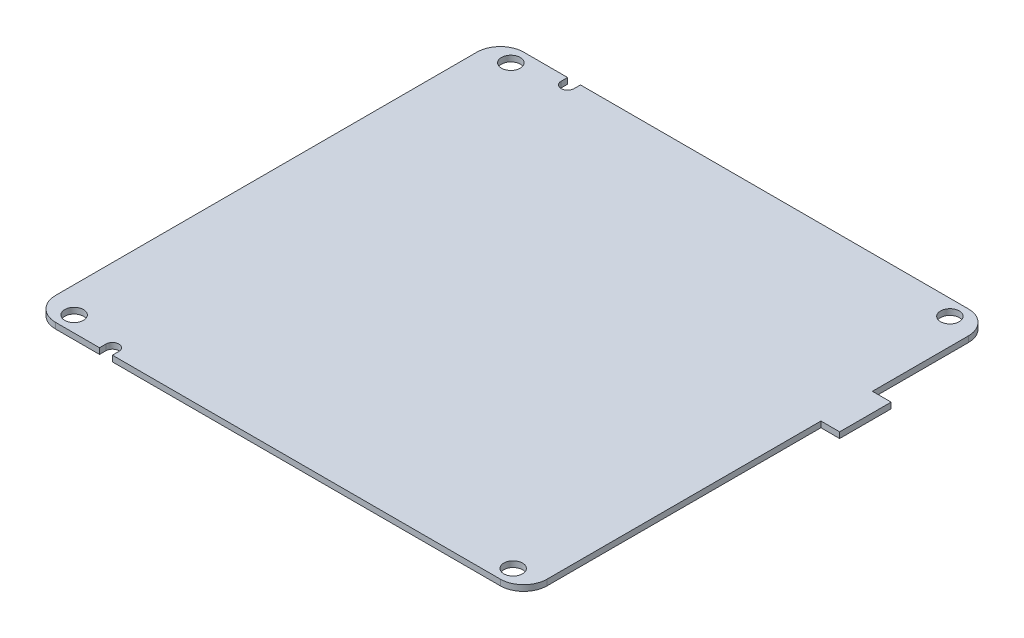
ISO-10303-21;
HEADER;
FILE_DESCRIPTION(('STEP AP214'),'2;1');
FILE_NAME('part.step','',(''),(''),'','','');
FILE_SCHEMA(('AUTOMOTIVE_DESIGN { 1 0 10303 214 1 1 1 1 }'));
ENDSEC;
DATA;
#1=APPLICATION_CONTEXT('core data for automotive mechanical design processes');
#2=APPLICATION_PROTOCOL_DEFINITION('international standard','automotive_design',2000,#1);
#3=PRODUCT_CONTEXT('',#1,'mechanical');
#4=PRODUCT('Part','Part','',(#3));
#5=PRODUCT_RELATED_PRODUCT_CATEGORY('part','',(#4));
#6=PRODUCT_DEFINITION_FORMATION('','',#4);
#7=PRODUCT_DEFINITION_CONTEXT('part definition',#1,'design');
#8=PRODUCT_DEFINITION('design','',#6,#7);
#9=PRODUCT_DEFINITION_SHAPE('','',#8);
#10=(LENGTH_UNIT() NAMED_UNIT(*) SI_UNIT(.MILLI.,.METRE.));
#11=(NAMED_UNIT(*) PLANE_ANGLE_UNIT() SI_UNIT($,.RADIAN.));
#12=(NAMED_UNIT(*) SI_UNIT($,.STERADIAN.) SOLID_ANGLE_UNIT());
#13=UNCERTAINTY_MEASURE_WITH_UNIT(LENGTH_MEASURE(1.E-05),#10,'distance_accuracy_value','');
#14=(GEOMETRIC_REPRESENTATION_CONTEXT(3) GLOBAL_UNCERTAINTY_ASSIGNED_CONTEXT((#13)) GLOBAL_UNIT_ASSIGNED_CONTEXT((#10,
#11,#12)) REPRESENTATION_CONTEXT('',''));
#15=CARTESIAN_POINT('',(0.,0.,0.));
#16=DIRECTION('',(0.,0.,1.));
#17=DIRECTION('',(1.,0.,0.));
#18=AXIS2_PLACEMENT_3D('',#15,#16,#17);
#19=CARTESIAN_POINT('',(0.,1.25,-50.));
#20=DIRECTION('',(0.,0.,-1.));
#21=DIRECTION('',(-1.,0.,0.));
#22=AXIS2_PLACEMENT_3D('',#19,#20,#21);
#23=PLANE('',#22);
#24=DIRECTION('',(1.,0.,0.));
#25=VECTOR('',#24,1.);
#26=CARTESIAN_POINT('',(0.,1.25,-50.));
#27=LINE('',#26,#25);
#28=CARTESIAN_POINT('',(-47.5,1.25,-50.));
#29=VERTEX_POINT('',#28);
#30=CARTESIAN_POINT('',(-38.125,1.25,-50.));
#31=VERTEX_POINT('',#30);
#32=EDGE_CURVE('E245',#29,#31,#27,.T.);
#33=ORIENTED_EDGE('',*,*,#32,.T.);
#34=DIRECTION('',(0.,1.,0.));
#35=VECTOR('',#34,1.);
#36=CARTESIAN_POINT('',(-38.125,-0.000999999999999916,-50.));
#37=LINE('',#36,#35);
#38=CARTESIAN_POINT('',(-38.125,0.,-50.));
#39=VERTEX_POINT('',#38);
#40=EDGE_CURVE('E197',#39,#31,#37,.T.);
#41=ORIENTED_EDGE('',*,*,#40,.F.);
#42=DIRECTION('',(1.,0.,0.));
#43=VECTOR('',#42,1.);
#44=CARTESIAN_POINT('',(0.,0.,-50.));
#45=LINE('',#44,#43);
#46=CARTESIAN_POINT('',(-47.5,0.,-50.));
#47=VERTEX_POINT('',#46);
#48=EDGE_CURVE('E267',#47,#39,#45,.T.);
#49=ORIENTED_EDGE('',*,*,#48,.F.);
#50=DIRECTION('',(0.,-1.,0.));
#51=VECTOR('',#50,1.);
#52=CARTESIAN_POINT('',(-47.5,1.25,-50.));
#53=LINE('',#52,#51);
#54=EDGE_CURVE('E309',#47,#29,#53,.F.);
#55=ORIENTED_EDGE('',*,*,#54,.T.);
#56=EDGE_LOOP('',(#33,#41,#49,#55));
#57=FACE_BOUND('',#56,.T.);
#58=ADVANCED_FACE('F33',(#57),#23,.T.);
#59=CARTESIAN_POINT('',(0.,1.25,50.));
#60=DIRECTION('',(0.,0.,-1.));
#61=DIRECTION('',(-1.,0.,0.));
#62=AXIS2_PLACEMENT_3D('',#59,#60,#61);
#63=PLANE('',#62);
#64=DIRECTION('',(0.,1.,0.));
#65=VECTOR('',#64,1.);
#66=CARTESIAN_POINT('',(-35.375,-0.000999999999999916,50.));
#67=LINE('',#66,#65);
#68=CARTESIAN_POINT('',(-35.375,0.,50.));
#69=VERTEX_POINT('',#68);
#70=CARTESIAN_POINT('',(-35.375,1.25,50.));
#71=VERTEX_POINT('',#70);
#72=EDGE_CURVE('E209',#69,#71,#67,.T.);
#73=ORIENTED_EDGE('',*,*,#72,.F.);
#74=DIRECTION('',(1.,0.,0.));
#75=VECTOR('',#74,1.);
#76=CARTESIAN_POINT('',(0.,0.,50.));
#77=LINE('',#76,#75);
#78=CARTESIAN_POINT('',(47.5,0.,50.));
#79=VERTEX_POINT('',#78);
#80=EDGE_CURVE('E273',#69,#79,#77,.T.);
#81=ORIENTED_EDGE('',*,*,#80,.T.);
#82=DIRECTION('',(0.,-1.,0.));
#83=VECTOR('',#82,1.);
#84=CARTESIAN_POINT('',(47.5,1.25,50.));
#85=LINE('',#84,#83);
#86=CARTESIAN_POINT('',(47.5,1.25,50.));
#87=VERTEX_POINT('',#86);
#88=EDGE_CURVE('E11',#79,#87,#85,.F.);
#89=ORIENTED_EDGE('',*,*,#88,.T.);
#90=DIRECTION('',(1.,0.,0.));
#91=VECTOR('',#90,1.);
#92=CARTESIAN_POINT('',(0.,1.25,50.));
#93=LINE('',#92,#91);
#94=EDGE_CURVE('E251',#71,#87,#93,.T.);
#95=ORIENTED_EDGE('',*,*,#94,.F.);
#96=EDGE_LOOP('',(#73,#81,#89,#95));
#97=FACE_BOUND('',#96,.T.);
#98=ADVANCED_FACE('F398',(#97),#63,.F.);
#99=CARTESIAN_POINT('',(0.,1.25,0.));
#100=DIRECTION('',(0.,1.,0.));
#101=DIRECTION('',(0.,0.,1.));
#102=AXIS2_PLACEMENT_3D('',#99,#100,#101);
#103=PLANE('',#102);
#104=CARTESIAN_POINT('',(46.9,1.25,46.65));
#105=DIRECTION('',(0.,1.,0.));
#106=DIRECTION('',(0.,0.,1.));
#107=AXIS2_PLACEMENT_3D('',#104,#105,#106);
#108=CIRCLE('',#107,2.);
#109=CARTESIAN_POINT('',(46.9,1.25,48.65));
#110=VERTEX_POINT('',#109);
#111=EDGE_CURVE('E621',#110,#110,#108,.F.);
#112=ORIENTED_EDGE('',*,*,#111,.T.);
#113=EDGE_LOOP('',(#112));
#114=FACE_BOUND('',#113,.T.);
#115=CARTESIAN_POINT('',(-36.75,1.25,48.625));
#116=DIRECTION('',(0.,1.,0.));
#117=DIRECTION('',(0.,0.,1.));
#118=AXIS2_PLACEMENT_3D('',#115,#116,#117);
#119=CIRCLE('',#118,1.375);
#120=CARTESIAN_POINT('',(-35.375,1.25,48.625));
#121=VERTEX_POINT('',#120);
#122=CARTESIAN_POINT('',(-38.125,1.25,48.625));
#123=VERTEX_POINT('',#122);
#124=EDGE_CURVE('E177',#121,#123,#119,.T.);
#125=ORIENTED_EDGE('',*,*,#124,.F.);
#126=DIRECTION('',(0.,0.,1.));
#127=VECTOR('',#126,1.);
#128=CARTESIAN_POINT('',(-35.375,1.25,0.));
#129=LINE('',#128,#127);
#130=EDGE_CURVE('E179',#121,#71,#129,.T.);
#131=ORIENTED_EDGE('',*,*,#130,.T.);
#132=ORIENTED_EDGE('',*,*,#94,.T.);
#133=CARTESIAN_POINT('',(47.5,1.25,45.));
#134=DIRECTION('',(0.,1.,0.));
#135=DIRECTION('',(0.,0.,1.));
#136=AXIS2_PLACEMENT_3D('',#133,#134,#135);
#137=CIRCLE('',#136,5.);
#138=CARTESIAN_POINT('',(52.5,1.25,45.));
#139=VERTEX_POINT('',#138);
#140=EDGE_CURVE('E313',#87,#139,#137,.T.);
#141=ORIENTED_EDGE('',*,*,#140,.T.);
#142=DIRECTION('',(0.,0.,1.));
#143=VECTOR('',#142,1.);
#144=CARTESIAN_POINT('',(52.5,1.25,0.));
#145=LINE('',#144,#143);
#146=CARTESIAN_POINT('',(52.5,1.25,-13.5));
#147=VERTEX_POINT('',#146);
#148=EDGE_CURVE('E244',#147,#139,#145,.T.);
#149=ORIENTED_EDGE('',*,*,#148,.F.);
#150=DIRECTION('',(1.,0.,0.));
#151=VECTOR('',#150,1.);
#152=CARTESIAN_POINT('',(0.,1.25,-13.5));
#153=LINE('',#152,#151);
#154=CARTESIAN_POINT('',(56.5,1.25,-13.5));
#155=VERTEX_POINT('',#154);
#156=EDGE_CURVE('E255',#147,#155,#153,.T.);
#157=ORIENTED_EDGE('',*,*,#156,.T.);
#158=DIRECTION('',(0.,0.,1.));
#159=VECTOR('',#158,1.);
#160=CARTESIAN_POINT('',(56.5,1.25,0.));
#161=LINE('',#160,#159);
#162=CARTESIAN_POINT('',(56.5,1.25,-24.5));
#163=VERTEX_POINT('',#162);
#164=EDGE_CURVE('E257',#163,#155,#161,.T.);
#165=ORIENTED_EDGE('',*,*,#164,.F.);
#166=DIRECTION('',(1.,0.,0.));
#167=VECTOR('',#166,1.);
#168=CARTESIAN_POINT('',(0.,1.25,-24.5));
#169=LINE('',#168,#167);
#170=CARTESIAN_POINT('',(52.5,1.25,-24.5));
#171=VERTEX_POINT('',#170);
#172=EDGE_CURVE('E260',#171,#163,#169,.T.);
#173=ORIENTED_EDGE('',*,*,#172,.F.);
#174=CARTESIAN_POINT('',(52.5,1.25,-45.));
#175=VERTEX_POINT('',#174);
#176=EDGE_CURVE('E240',#175,#171,#145,.T.);
#177=ORIENTED_EDGE('',*,*,#176,.F.);
#178=CARTESIAN_POINT('',(47.5,1.25,-45.));
#179=DIRECTION('',(0.,1.,0.));
#180=DIRECTION('',(0.,0.,1.));
#181=AXIS2_PLACEMENT_3D('',#178,#179,#180);
#182=CIRCLE('',#181,5.);
#183=CARTESIAN_POINT('',(47.5,1.25,-50.));
#184=VERTEX_POINT('',#183);
#185=EDGE_CURVE('E315',#175,#184,#182,.T.);
#186=ORIENTED_EDGE('',*,*,#185,.T.);
#187=CARTESIAN_POINT('',(-35.375,1.25,-50.));
#188=VERTEX_POINT('',#187);
#189=EDGE_CURVE('E242',#188,#184,#27,.T.);
#190=ORIENTED_EDGE('',*,*,#189,.F.);
#191=DIRECTION('',(0.,0.,-1.));
#192=VECTOR('',#191,1.);
#193=CARTESIAN_POINT('',(-35.375,1.25,0.));
#194=LINE('',#193,#192);
#195=CARTESIAN_POINT('',(-35.375,1.25,-48.625));
#196=VERTEX_POINT('',#195);
#197=EDGE_CURVE('E223',#196,#188,#194,.T.);
#198=ORIENTED_EDGE('',*,*,#197,.F.);
#199=CARTESIAN_POINT('',(-36.75,1.25,-48.625));
#200=DIRECTION('',(0.,1.,0.));
#201=DIRECTION('',(0.,0.,1.));
#202=AXIS2_PLACEMENT_3D('',#199,#200,#201);
#203=CIRCLE('',#202,1.375);
#204=CARTESIAN_POINT('',(-38.125,1.25,-48.625));
#205=VERTEX_POINT('',#204);
#206=EDGE_CURVE('E220',#196,#205,#203,.F.);
#207=ORIENTED_EDGE('',*,*,#206,.T.);
#208=DIRECTION('',(0.,0.,-1.));
#209=VECTOR('',#208,1.);
#210=CARTESIAN_POINT('',(-38.125,1.25,0.));
#211=LINE('',#210,#209);
#212=EDGE_CURVE('E217',#205,#31,#211,.T.);
#213=ORIENTED_EDGE('',*,*,#212,.T.);
#214=ORIENTED_EDGE('',*,*,#32,.F.);
#215=CARTESIAN_POINT('',(-47.5,1.25,-45.));
#216=DIRECTION('',(0.,1.,0.));
#217=DIRECTION('',(0.,0.,1.));
#218=AXIS2_PLACEMENT_3D('',#215,#216,#217);
#219=CIRCLE('',#218,5.);
#220=CARTESIAN_POINT('',(-52.5,1.25,-45.));
#221=VERTEX_POINT('',#220);
#222=EDGE_CURVE('E318',#29,#221,#219,.T.);
#223=ORIENTED_EDGE('',*,*,#222,.T.);
#224=DIRECTION('',(0.,0.,1.));
#225=VECTOR('',#224,1.);
#226=CARTESIAN_POINT('',(-52.5,1.25,0.));
#227=LINE('',#226,#225);
#228=CARTESIAN_POINT('',(-52.5,1.25,45.));
#229=VERTEX_POINT('',#228);
#230=EDGE_CURVE('E248',#221,#229,#227,.T.);
#231=ORIENTED_EDGE('',*,*,#230,.T.);
#232=CARTESIAN_POINT('',(-47.5,1.25,45.));
#233=DIRECTION('',(0.,1.,0.));
#234=DIRECTION('',(0.,0.,1.));
#235=AXIS2_PLACEMENT_3D('',#232,#233,#234);
#236=CIRCLE('',#235,5.);
#237=CARTESIAN_POINT('',(-47.5,1.25,50.));
#238=VERTEX_POINT('',#237);
#239=EDGE_CURVE('E311',#229,#238,#236,.T.);
#240=ORIENTED_EDGE('',*,*,#239,.T.);
#241=CARTESIAN_POINT('',(-38.125,1.25,50.));
#242=VERTEX_POINT('',#241);
#243=EDGE_CURVE('E252',#238,#242,#93,.T.);
#244=ORIENTED_EDGE('',*,*,#243,.T.);
#245=DIRECTION('',(0.,0.,1.));
#246=VECTOR('',#245,1.);
#247=CARTESIAN_POINT('',(-38.125,1.25,0.));
#248=LINE('',#247,#246);
#249=EDGE_CURVE('E204',#123,#242,#248,.T.);
#250=ORIENTED_EDGE('',*,*,#249,.F.);
#251=EDGE_LOOP('',(#125,#131,#132,#141,#149,#157,#165,#173,#177,#186,#190,#198,#207,#213,#214,
#223,#231,#240,#244,#250));
#252=FACE_BOUND('',#251,.T.);
#253=CARTESIAN_POINT('',(-46.9,1.25,-46.65));
#254=DIRECTION('',(0.,1.,0.));
#255=DIRECTION('',(0.,0.,1.));
#256=AXIS2_PLACEMENT_3D('',#253,#254,#255);
#257=CIRCLE('',#256,2.);
#258=CARTESIAN_POINT('',(-46.9,1.25,-44.65));
#259=VERTEX_POINT('',#258);
#260=EDGE_CURVE('E232',#259,#259,#257,.F.);
#261=ORIENTED_EDGE('',*,*,#260,.T.);
#262=EDGE_LOOP('',(#261));
#263=FACE_BOUND('',#262,.T.);
#264=CARTESIAN_POINT('',(-46.9,1.25,46.65));
#265=DIRECTION('',(0.,1.,0.));
#266=DIRECTION('',(0.,0.,1.));
#267=AXIS2_PLACEMENT_3D('',#264,#265,#266);
#268=CIRCLE('',#267,2.);
#269=CARTESIAN_POINT('',(-46.9,1.25,48.65));
#270=VERTEX_POINT('',#269);
#271=EDGE_CURVE('E186',#270,#270,#268,.T.);
#272=ORIENTED_EDGE('',*,*,#271,.F.);
#273=EDGE_LOOP('',(#272));
#274=FACE_BOUND('',#273,.T.);
#275=CARTESIAN_POINT('',(46.9,1.25,-46.65));
#276=DIRECTION('',(0.,1.,0.));
#277=DIRECTION('',(0.,0.,1.));
#278=AXIS2_PLACEMENT_3D('',#275,#276,#277);
#279=CIRCLE('',#278,2.);
#280=CARTESIAN_POINT('',(46.9,1.25,-44.65));
#281=VERTEX_POINT('',#280);
#282=EDGE_CURVE('E616',#281,#281,#279,.T.);
#283=ORIENTED_EDGE('',*,*,#282,.F.);
#284=EDGE_LOOP('',(#283));
#285=FACE_BOUND('',#284,.T.);
#286=ADVANCED_FACE('F338',(#114,#252,#263,#274,#285),#103,.T.);
#287=CARTESIAN_POINT('',(0.,0.,0.));
#288=DIRECTION('',(0.,1.,0.));
#289=DIRECTION('',(0.,0.,1.));
#290=AXIS2_PLACEMENT_3D('',#287,#288,#289);
#291=PLANE('',#290);
#292=CARTESIAN_POINT('',(-46.9,0.,46.65));
#293=DIRECTION('',(0.,1.,0.));
#294=DIRECTION('',(0.,0.,1.));
#295=AXIS2_PLACEMENT_3D('',#292,#293,#294);
#296=CIRCLE('',#295,2.);
#297=CARTESIAN_POINT('',(-46.9,0.,48.65));
#298=VERTEX_POINT('',#297);
#299=EDGE_CURVE('E200',#298,#298,#296,.F.);
#300=ORIENTED_EDGE('',*,*,#299,.F.);
#301=EDGE_LOOP('',(#300));
#302=FACE_BOUND('',#301,.T.);
#303=DIRECTION('',(0.,0.,-1.));
#304=VECTOR('',#303,1.);
#305=CARTESIAN_POINT('',(-35.375,0.,0.));
#306=LINE('',#305,#304);
#307=CARTESIAN_POINT('',(-35.375,0.,48.625));
#308=VERTEX_POINT('',#307);
#309=EDGE_CURVE('E192',#69,#308,#306,.T.);
#310=ORIENTED_EDGE('',*,*,#309,.T.);
#311=CARTESIAN_POINT('',(-36.75,0.,48.625));
#312=DIRECTION('',(0.,1.,0.));
#313=DIRECTION('',(0.,0.,1.));
#314=AXIS2_PLACEMENT_3D('',#311,#312,#313);
#315=CIRCLE('',#314,1.375);
#316=CARTESIAN_POINT('',(-38.125,0.,48.625));
#317=VERTEX_POINT('',#316);
#318=EDGE_CURVE('E174',#317,#308,#315,.F.);
#319=ORIENTED_EDGE('',*,*,#318,.F.);
#320=DIRECTION('',(0.,0.,-1.));
#321=VECTOR('',#320,1.);
#322=CARTESIAN_POINT('',(-38.125,0.,0.));
#323=LINE('',#322,#321);
#324=CARTESIAN_POINT('',(-38.125,0.,50.));
#325=VERTEX_POINT('',#324);
#326=EDGE_CURVE('E181',#325,#317,#323,.T.);
#327=ORIENTED_EDGE('',*,*,#326,.F.);
#328=CARTESIAN_POINT('',(-47.5,0.,50.));
#329=VERTEX_POINT('',#328);
#330=EDGE_CURVE('E274',#329,#325,#77,.T.);
#331=ORIENTED_EDGE('',*,*,#330,.F.);
#332=CARTESIAN_POINT('',(-47.5,0.,45.));
#333=DIRECTION('',(0.,1.,0.));
#334=DIRECTION('',(0.,0.,1.));
#335=AXIS2_PLACEMENT_3D('',#332,#333,#334);
#336=CIRCLE('',#335,5.);
#337=CARTESIAN_POINT('',(-52.5,0.,45.));
#338=VERTEX_POINT('',#337);
#339=EDGE_CURVE('E297',#329,#338,#336,.F.);
#340=ORIENTED_EDGE('',*,*,#339,.T.);
#341=DIRECTION('',(0.,0.,1.));
#342=VECTOR('',#341,1.);
#343=CARTESIAN_POINT('',(-52.5,0.,0.));
#344=LINE('',#343,#342);
#345=CARTESIAN_POINT('',(-52.5,0.,-45.));
#346=VERTEX_POINT('',#345);
#347=EDGE_CURVE('E270',#346,#338,#344,.T.);
#348=ORIENTED_EDGE('',*,*,#347,.F.);
#349=CARTESIAN_POINT('',(-47.5,0.,-45.));
#350=DIRECTION('',(0.,1.,0.));
#351=DIRECTION('',(0.,0.,1.));
#352=AXIS2_PLACEMENT_3D('',#349,#350,#351);
#353=CIRCLE('',#352,5.);
#354=EDGE_CURVE('E304',#346,#47,#353,.F.);
#355=ORIENTED_EDGE('',*,*,#354,.T.);
#356=ORIENTED_EDGE('',*,*,#48,.T.);
#357=DIRECTION('',(0.,0.,1.));
#358=VECTOR('',#357,1.);
#359=CARTESIAN_POINT('',(-38.125,0.,0.));
#360=LINE('',#359,#358);
#361=CARTESIAN_POINT('',(-38.125,0.,-48.625));
#362=VERTEX_POINT('',#361);
#363=EDGE_CURVE('E214',#39,#362,#360,.T.);
#364=ORIENTED_EDGE('',*,*,#363,.T.);
#365=CARTESIAN_POINT('',(-36.75,0.,-48.625));
#366=DIRECTION('',(0.,1.,0.));
#367=DIRECTION('',(0.,0.,1.));
#368=AXIS2_PLACEMENT_3D('',#365,#366,#367);
#369=CIRCLE('',#368,1.375);
#370=CARTESIAN_POINT('',(-35.375,0.,-48.625));
#371=VERTEX_POINT('',#370);
#372=EDGE_CURVE('E193',#362,#371,#369,.T.);
#373=ORIENTED_EDGE('',*,*,#372,.T.);
#374=DIRECTION('',(0.,0.,1.));
#375=VECTOR('',#374,1.);
#376=CARTESIAN_POINT('',(-35.375,0.,0.));
#377=LINE('',#376,#375);
#378=CARTESIAN_POINT('',(-35.375,0.,-50.));
#379=VERTEX_POINT('',#378);
#380=EDGE_CURVE('E212',#379,#371,#377,.T.);
#381=ORIENTED_EDGE('',*,*,#380,.F.);
#382=CARTESIAN_POINT('',(47.5,0.,-50.));
#383=VERTEX_POINT('',#382);
#384=EDGE_CURVE('E265',#379,#383,#45,.T.);
#385=ORIENTED_EDGE('',*,*,#384,.T.);
#386=CARTESIAN_POINT('',(47.5,0.,-45.));
#387=DIRECTION('',(0.,1.,0.));
#388=DIRECTION('',(0.,0.,1.));
#389=AXIS2_PLACEMENT_3D('',#386,#387,#388);
#390=CIRCLE('',#389,5.);
#391=CARTESIAN_POINT('',(52.5,0.,-45.));
#392=VERTEX_POINT('',#391);
#393=EDGE_CURVE('E302',#383,#392,#390,.F.);
#394=ORIENTED_EDGE('',*,*,#393,.T.);
#395=DIRECTION('',(0.,0.,1.));
#396=VECTOR('',#395,1.);
#397=CARTESIAN_POINT('',(52.5,0.,0.));
#398=LINE('',#397,#396);
#399=CARTESIAN_POINT('',(52.5,0.,-24.5));
#400=VERTEX_POINT('',#399);
#401=EDGE_CURVE('E235',#392,#400,#398,.T.);
#402=ORIENTED_EDGE('',*,*,#401,.T.);
#403=DIRECTION('',(1.,0.,0.));
#404=VECTOR('',#403,1.);
#405=CARTESIAN_POINT('',(0.,0.,-24.5));
#406=LINE('',#405,#404);
#407=CARTESIAN_POINT('',(56.5,0.,-24.5));
#408=VERTEX_POINT('',#407);
#409=EDGE_CURVE('E243',#400,#408,#406,.T.);
#410=ORIENTED_EDGE('',*,*,#409,.T.);
#411=DIRECTION('',(0.,0.,1.));
#412=VECTOR('',#411,1.);
#413=CARTESIAN_POINT('',(56.5,0.,0.));
#414=LINE('',#413,#412);
#415=CARTESIAN_POINT('',(56.5,0.,-13.5));
#416=VERTEX_POINT('',#415);
#417=EDGE_CURVE('E279',#408,#416,#414,.T.);
#418=ORIENTED_EDGE('',*,*,#417,.T.);
#419=DIRECTION('',(1.,0.,0.));
#420=VECTOR('',#419,1.);
#421=CARTESIAN_POINT('',(0.,0.,-13.5));
#422=LINE('',#421,#420);
#423=CARTESIAN_POINT('',(52.5,0.,-13.5));
#424=VERTEX_POINT('',#423);
#425=EDGE_CURVE('E276',#424,#416,#422,.T.);
#426=ORIENTED_EDGE('',*,*,#425,.F.);
#427=CARTESIAN_POINT('',(52.5,0.,45.));
#428=VERTEX_POINT('',#427);
#429=EDGE_CURVE('E266',#424,#428,#398,.T.);
#430=ORIENTED_EDGE('',*,*,#429,.T.);
#431=CARTESIAN_POINT('',(47.5,0.,45.));
#432=DIRECTION('',(0.,1.,0.));
#433=DIRECTION('',(0.,0.,1.));
#434=AXIS2_PLACEMENT_3D('',#431,#432,#433);
#435=CIRCLE('',#434,5.);
#436=EDGE_CURVE('E299',#428,#79,#435,.F.);
#437=ORIENTED_EDGE('',*,*,#436,.T.);
#438=ORIENTED_EDGE('',*,*,#80,.F.);
#439=EDGE_LOOP('',(#310,#319,#327,#331,#340,#348,#355,#356,#364,#373,#381,#385,#394,#402,#410,
#418,#426,#430,#437,#438));
#440=FACE_BOUND('',#439,.T.);
#441=CARTESIAN_POINT('',(-46.9,0.,-46.65));
#442=DIRECTION('',(0.,1.,0.));
#443=DIRECTION('',(0.,0.,1.));
#444=AXIS2_PLACEMENT_3D('',#441,#442,#443);
#445=CIRCLE('',#444,2.);
#446=CARTESIAN_POINT('',(-46.9,0.,-44.65));
#447=VERTEX_POINT('',#446);
#448=EDGE_CURVE('E236',#447,#447,#445,.T.);
#449=ORIENTED_EDGE('',*,*,#448,.T.);
#450=EDGE_LOOP('',(#449));
#451=FACE_BOUND('',#450,.T.);
#452=CARTESIAN_POINT('',(46.9,0.,46.65));
#453=DIRECTION('',(0.,1.,0.));
#454=DIRECTION('',(0.,0.,1.));
#455=AXIS2_PLACEMENT_3D('',#452,#453,#454);
#456=CIRCLE('',#455,2.);
#457=CARTESIAN_POINT('',(46.9,0.,48.65));
#458=VERTEX_POINT('',#457);
#459=EDGE_CURVE('E625',#458,#458,#456,.T.);
#460=ORIENTED_EDGE('',*,*,#459,.T.);
#461=EDGE_LOOP('',(#460));
#462=FACE_BOUND('',#461,.T.);
#463=CARTESIAN_POINT('',(46.9,0.,-46.65));
#464=DIRECTION('',(0.,1.,0.));
#465=DIRECTION('',(0.,0.,1.));
#466=AXIS2_PLACEMENT_3D('',#463,#464,#465);
#467=CIRCLE('',#466,2.);
#468=CARTESIAN_POINT('',(46.9,0.,-44.65));
#469=VERTEX_POINT('',#468);
#470=EDGE_CURVE('E239',#469,#469,#467,.F.);
#471=ORIENTED_EDGE('',*,*,#470,.F.);
#472=EDGE_LOOP('',(#471));
#473=FACE_BOUND('',#472,.T.);
#474=ADVANCED_FACE('F189',(#302,#440,#451,#462,#473),#291,.F.);
#475=CARTESIAN_POINT('',(52.5,1.25,0.));
#476=DIRECTION('',(1.,0.,0.));
#477=DIRECTION('',(0.,0.,-1.));
#478=AXIS2_PLACEMENT_3D('',#475,#476,#477);
#479=PLANE('',#478);
#480=ORIENTED_EDGE('',*,*,#401,.F.);
#481=DIRECTION('',(0.,-1.,0.));
#482=VECTOR('',#481,1.);
#483=CARTESIAN_POINT('',(52.5,1.25,-45.));
#484=LINE('',#483,#482);
#485=EDGE_CURVE('E320',#392,#175,#484,.F.);
#486=ORIENTED_EDGE('',*,*,#485,.T.);
#487=ORIENTED_EDGE('',*,*,#176,.T.);
#488=DIRECTION('',(0.,-1.,0.));
#489=VECTOR('',#488,1.);
#490=CARTESIAN_POINT('',(52.5,1.25,-24.5));
#491=LINE('',#490,#489);
#492=EDGE_CURVE('E263',#171,#400,#491,.T.);
#493=ORIENTED_EDGE('',*,*,#492,.T.);
#494=EDGE_LOOP('',(#480,#486,#487,#493));
#495=FACE_BOUND('',#494,.T.);
#496=ADVANCED_FACE('F368',(#495),#479,.T.);
#497=DIRECTION('',(0.,1.,0.));
#498=VECTOR('',#497,1.);
#499=CARTESIAN_POINT('',(-35.375,-0.000999999999999916,-50.));
#500=LINE('',#499,#498);
#501=EDGE_CURVE('E227',#379,#188,#500,.T.);
#502=ORIENTED_EDGE('',*,*,#501,.T.);
#503=ORIENTED_EDGE('',*,*,#189,.T.);
#504=DIRECTION('',(0.,-1.,0.));
#505=VECTOR('',#504,1.);
#506=CARTESIAN_POINT('',(47.5,1.25,-50.));
#507=LINE('',#506,#505);
#508=EDGE_CURVE('E306',#184,#383,#507,.T.);
#509=ORIENTED_EDGE('',*,*,#508,.T.);
#510=ORIENTED_EDGE('',*,*,#384,.F.);
#511=EDGE_LOOP('',(#502,#503,#509,#510));
#512=FACE_BOUND('',#511,.T.);
#513=ADVANCED_FACE('F360',(#512),#23,.T.);
#514=CARTESIAN_POINT('',(-52.5,1.25,0.));
#515=DIRECTION('',(1.,0.,0.));
#516=DIRECTION('',(0.,0.,-1.));
#517=AXIS2_PLACEMENT_3D('',#514,#515,#516);
#518=PLANE('',#517);
#519=ORIENTED_EDGE('',*,*,#230,.F.);
#520=DIRECTION('',(0.,-1.,0.));
#521=VECTOR('',#520,1.);
#522=CARTESIAN_POINT('',(-52.5,0.,-45.));
#523=LINE('',#522,#521);
#524=EDGE_CURVE('E294',#221,#346,#523,.T.);
#525=ORIENTED_EDGE('',*,*,#524,.T.);
#526=ORIENTED_EDGE('',*,*,#347,.T.);
#527=DIRECTION('',(0.,-1.,0.));
#528=VECTOR('',#527,1.);
#529=CARTESIAN_POINT('',(-52.5,1.25,45.));
#530=LINE('',#529,#528);
#531=EDGE_CURVE('E292',#338,#229,#530,.F.);
#532=ORIENTED_EDGE('',*,*,#531,.T.);
#533=EDGE_LOOP('',(#519,#525,#526,#532));
#534=FACE_BOUND('',#533,.T.);
#535=ADVANCED_FACE('F335',(#534),#518,.F.);
#536=ORIENTED_EDGE('',*,*,#330,.T.);
#537=DIRECTION('',(0.,1.,0.));
#538=VECTOR('',#537,1.);
#539=CARTESIAN_POINT('',(-38.125,-0.000999999999999916,50.));
#540=LINE('',#539,#538);
#541=EDGE_CURVE('E56',#325,#242,#540,.T.);
#542=ORIENTED_EDGE('',*,*,#541,.T.);
#543=ORIENTED_EDGE('',*,*,#243,.F.);
#544=DIRECTION('',(0.,-1.,0.));
#545=VECTOR('',#544,1.);
#546=CARTESIAN_POINT('',(-47.5,1.25,50.));
#547=LINE('',#546,#545);
#548=EDGE_CURVE('E41',#238,#329,#547,.T.);
#549=ORIENTED_EDGE('',*,*,#548,.T.);
#550=EDGE_LOOP('',(#536,#542,#543,#549));
#551=FACE_BOUND('',#550,.T.);
#552=ADVANCED_FACE('F328',(#551),#63,.F.);
#553=ORIENTED_EDGE('',*,*,#148,.T.);
#554=DIRECTION('',(0.,-1.,0.));
#555=VECTOR('',#554,1.);
#556=CARTESIAN_POINT('',(52.5,0.,45.));
#557=LINE('',#556,#555);
#558=EDGE_CURVE('E322',#139,#428,#557,.T.);
#559=ORIENTED_EDGE('',*,*,#558,.T.);
#560=ORIENTED_EDGE('',*,*,#429,.F.);
#561=DIRECTION('',(0.,-1.,0.));
#562=VECTOR('',#561,1.);
#563=CARTESIAN_POINT('',(52.5,1.25,-13.5));
#564=LINE('',#563,#562);
#565=EDGE_CURVE('E290',#147,#424,#564,.T.);
#566=ORIENTED_EDGE('',*,*,#565,.F.);
#567=EDGE_LOOP('',(#553,#559,#560,#566));
#568=FACE_BOUND('',#567,.T.);
#569=ADVANCED_FACE('F389',(#568),#479,.T.);
#570=CARTESIAN_POINT('',(0.,1.25,-13.5));
#571=DIRECTION('',(0.,0.,-1.));
#572=DIRECTION('',(-1.,0.,0.));
#573=AXIS2_PLACEMENT_3D('',#570,#571,#572);
#574=PLANE('',#573);
#575=ORIENTED_EDGE('',*,*,#425,.T.);
#576=DIRECTION('',(0.,-1.,0.));
#577=VECTOR('',#576,1.);
#578=CARTESIAN_POINT('',(56.5,1.25,-13.5));
#579=LINE('',#578,#577);
#580=EDGE_CURVE('E288',#155,#416,#579,.T.);
#581=ORIENTED_EDGE('',*,*,#580,.F.);
#582=ORIENTED_EDGE('',*,*,#156,.F.);
#583=ORIENTED_EDGE('',*,*,#565,.T.);
#584=EDGE_LOOP('',(#575,#581,#582,#583));
#585=FACE_BOUND('',#584,.T.);
#586=ADVANCED_FACE('F385',(#585),#574,.F.);
#587=CARTESIAN_POINT('',(56.5,1.25,0.));
#588=DIRECTION('',(1.,0.,0.));
#589=DIRECTION('',(0.,0.,-1.));
#590=AXIS2_PLACEMENT_3D('',#587,#588,#589);
#591=PLANE('',#590);
#592=ORIENTED_EDGE('',*,*,#417,.F.);
#593=DIRECTION('',(0.,-1.,0.));
#594=VECTOR('',#593,1.);
#595=CARTESIAN_POINT('',(56.5,1.25,-24.5));
#596=LINE('',#595,#594);
#597=EDGE_CURVE('E286',#163,#408,#596,.T.);
#598=ORIENTED_EDGE('',*,*,#597,.F.);
#599=ORIENTED_EDGE('',*,*,#164,.T.);
#600=ORIENTED_EDGE('',*,*,#580,.T.);
#601=EDGE_LOOP('',(#592,#598,#599,#600));
#602=FACE_BOUND('',#601,.T.);
#603=ADVANCED_FACE('F380',(#602),#591,.T.);
#604=CARTESIAN_POINT('',(0.,1.25,-24.5));
#605=DIRECTION('',(0.,0.,-1.));
#606=DIRECTION('',(-1.,0.,0.));
#607=AXIS2_PLACEMENT_3D('',#604,#605,#606);
#608=PLANE('',#607);
#609=ORIENTED_EDGE('',*,*,#409,.F.);
#610=ORIENTED_EDGE('',*,*,#492,.F.);
#611=ORIENTED_EDGE('',*,*,#172,.T.);
#612=ORIENTED_EDGE('',*,*,#597,.T.);
#613=EDGE_LOOP('',(#609,#610,#611,#612));
#614=FACE_BOUND('',#613,.T.);
#615=ADVANCED_FACE('F374',(#614),#608,.T.);
#616=CARTESIAN_POINT('',(-47.5,1.25,-45.));
#617=DIRECTION('',(0.,1.,0.));
#618=DIRECTION('',(0.,0.,1.));
#619=AXIS2_PLACEMENT_3D('',#616,#617,#618);
#620=CYLINDRICAL_SURFACE('',#619,5.);
#621=ORIENTED_EDGE('',*,*,#222,.F.);
#622=ORIENTED_EDGE('',*,*,#54,.F.);
#623=ORIENTED_EDGE('',*,*,#354,.F.);
#624=ORIENTED_EDGE('',*,*,#524,.F.);
#625=EDGE_LOOP('',(#621,#622,#623,#624));
#626=FACE_BOUND('',#625,.T.);
#627=ADVANCED_FACE('F343',(#626),#620,.T.);
#628=CARTESIAN_POINT('',(47.5,1.25,-45.));
#629=DIRECTION('',(0.,-1.,0.));
#630=DIRECTION('',(0.,0.,-1.));
#631=AXIS2_PLACEMENT_3D('',#628,#629,#630);
#632=CYLINDRICAL_SURFACE('',#631,5.);
#633=ORIENTED_EDGE('',*,*,#185,.F.);
#634=ORIENTED_EDGE('',*,*,#485,.F.);
#635=ORIENTED_EDGE('',*,*,#393,.F.);
#636=ORIENTED_EDGE('',*,*,#508,.F.);
#637=EDGE_LOOP('',(#633,#634,#635,#636));
#638=FACE_BOUND('',#637,.T.);
#639=ADVANCED_FACE('F364',(#638),#632,.T.);
#640=CARTESIAN_POINT('',(47.5,1.25,45.));
#641=DIRECTION('',(0.,1.,0.));
#642=DIRECTION('',(0.,0.,1.));
#643=AXIS2_PLACEMENT_3D('',#640,#641,#642);
#644=CYLINDRICAL_SURFACE('',#643,5.);
#645=ORIENTED_EDGE('',*,*,#140,.F.);
#646=ORIENTED_EDGE('',*,*,#88,.F.);
#647=ORIENTED_EDGE('',*,*,#436,.F.);
#648=ORIENTED_EDGE('',*,*,#558,.F.);
#649=EDGE_LOOP('',(#645,#646,#647,#648));
#650=FACE_BOUND('',#649,.T.);
#651=ADVANCED_FACE('F394',(#650),#644,.T.);
#652=CARTESIAN_POINT('',(-47.5,1.25,45.));
#653=DIRECTION('',(0.,-1.,0.));
#654=DIRECTION('',(0.,0.,-1.));
#655=AXIS2_PLACEMENT_3D('',#652,#653,#654);
#656=CYLINDRICAL_SURFACE('',#655,5.);
#657=ORIENTED_EDGE('',*,*,#239,.F.);
#658=ORIENTED_EDGE('',*,*,#531,.F.);
#659=ORIENTED_EDGE('',*,*,#339,.F.);
#660=ORIENTED_EDGE('',*,*,#548,.F.);
#661=EDGE_LOOP('',(#657,#658,#659,#660));
#662=FACE_BOUND('',#661,.T.);
#663=ADVANCED_FACE('F35',(#662),#656,.T.);
#664=CARTESIAN_POINT('',(-46.9,-0.000999999999999916,-46.65));
#665=DIRECTION('',(0.,1.,0.));
#666=DIRECTION('',(0.,0.,1.));
#667=AXIS2_PLACEMENT_3D('',#664,#665,#666);
#668=CYLINDRICAL_SURFACE('',#667,2.);
#669=ORIENTED_EDGE('',*,*,#260,.F.);
#670=EDGE_LOOP('',(#669));
#671=FACE_BOUND('',#670,.T.);
#672=ORIENTED_EDGE('',*,*,#448,.F.);
#673=EDGE_LOOP('',(#672));
#674=FACE_BOUND('',#673,.T.);
#675=ADVANCED_FACE('F486',(#671,#674),#668,.F.);
#676=CARTESIAN_POINT('',(-38.125,-0.000999999999999916,0.));
#677=DIRECTION('',(1.,0.,0.));
#678=DIRECTION('',(0.,0.,-1.));
#679=AXIS2_PLACEMENT_3D('',#676,#677,#678);
#680=PLANE('',#679);
#681=ORIENTED_EDGE('',*,*,#40,.T.);
#682=ORIENTED_EDGE('',*,*,#212,.F.);
#683=DIRECTION('',(0.,1.,0.));
#684=VECTOR('',#683,1.);
#685=CARTESIAN_POINT('',(-38.125,-0.000999999999999916,-48.625));
#686=LINE('',#685,#684);
#687=EDGE_CURVE('E225',#362,#205,#686,.T.);
#688=ORIENTED_EDGE('',*,*,#687,.F.);
#689=ORIENTED_EDGE('',*,*,#363,.F.);
#690=EDGE_LOOP('',(#681,#682,#688,#689));
#691=FACE_BOUND('',#690,.T.);
#692=ADVANCED_FACE('F350',(#691),#680,.T.);
#693=CARTESIAN_POINT('',(-35.375,-0.000999999999999916,0.));
#694=DIRECTION('',(1.,0.,0.));
#695=DIRECTION('',(0.,0.,-1.));
#696=AXIS2_PLACEMENT_3D('',#693,#694,#695);
#697=PLANE('',#696);
#698=ORIENTED_EDGE('',*,*,#380,.T.);
#699=DIRECTION('',(0.,1.,0.));
#700=VECTOR('',#699,1.);
#701=CARTESIAN_POINT('',(-35.375,-0.000999999999999916,-48.625));
#702=LINE('',#701,#700);
#703=EDGE_CURVE('E48',#371,#196,#702,.T.);
#704=ORIENTED_EDGE('',*,*,#703,.T.);
#705=ORIENTED_EDGE('',*,*,#197,.T.);
#706=ORIENTED_EDGE('',*,*,#501,.F.);
#707=EDGE_LOOP('',(#698,#704,#705,#706));
#708=FACE_BOUND('',#707,.T.);
#709=ADVANCED_FACE('F555',(#708),#697,.F.);
#710=CARTESIAN_POINT('',(-36.75,-0.000999999999999916,-48.625));
#711=DIRECTION('',(0.,1.,0.));
#712=DIRECTION('',(0.,0.,1.));
#713=AXIS2_PLACEMENT_3D('',#710,#711,#712);
#714=CYLINDRICAL_SURFACE('',#713,1.375);
#715=ORIENTED_EDGE('',*,*,#687,.T.);
#716=ORIENTED_EDGE('',*,*,#206,.F.);
#717=ORIENTED_EDGE('',*,*,#703,.F.);
#718=ORIENTED_EDGE('',*,*,#372,.F.);
#719=EDGE_LOOP('',(#715,#716,#717,#718));
#720=FACE_BOUND('',#719,.T.);
#721=ADVANCED_FACE('F354',(#720),#714,.F.);
#722=CARTESIAN_POINT('',(-36.75,-0.000999999999999916,48.625));
#723=DIRECTION('',(0.,1.,0.));
#724=DIRECTION('',(0.,0.,1.));
#725=AXIS2_PLACEMENT_3D('',#722,#723,#724);
#726=CYLINDRICAL_SURFACE('',#725,1.375);
#727=ORIENTED_EDGE('',*,*,#318,.T.);
#728=DIRECTION('',(0.,1.,0.));
#729=VECTOR('',#728,1.);
#730=CARTESIAN_POINT('',(-35.375,-0.000999999999999916,48.625));
#731=LINE('',#730,#729);
#732=EDGE_CURVE('E187',#308,#121,#731,.T.);
#733=ORIENTED_EDGE('',*,*,#732,.T.);
#734=ORIENTED_EDGE('',*,*,#124,.T.);
#735=DIRECTION('',(0.,1.,0.));
#736=VECTOR('',#735,1.);
#737=CARTESIAN_POINT('',(-38.125,-0.000999999999999916,48.625));
#738=LINE('',#737,#736);
#739=EDGE_CURVE('E171',#317,#123,#738,.T.);
#740=ORIENTED_EDGE('',*,*,#739,.F.);
#741=EDGE_LOOP('',(#727,#733,#734,#740));
#742=FACE_BOUND('',#741,.T.);
#743=ADVANCED_FACE('F172',(#742),#726,.F.);
#744=CARTESIAN_POINT('',(-35.375,-0.000999999999999916,0.));
#745=DIRECTION('',(-1.,0.,0.));
#746=DIRECTION('',(0.,0.,1.));
#747=AXIS2_PLACEMENT_3D('',#744,#745,#746);
#748=PLANE('',#747);
#749=ORIENTED_EDGE('',*,*,#72,.T.);
#750=ORIENTED_EDGE('',*,*,#130,.F.);
#751=ORIENTED_EDGE('',*,*,#732,.F.);
#752=ORIENTED_EDGE('',*,*,#309,.F.);
#753=EDGE_LOOP('',(#749,#750,#751,#752));
#754=FACE_BOUND('',#753,.T.);
#755=ADVANCED_FACE('F401',(#754),#748,.T.);
#756=CARTESIAN_POINT('',(-38.125,-0.000999999999999916,0.));
#757=DIRECTION('',(-1.,0.,0.));
#758=DIRECTION('',(0.,0.,1.));
#759=AXIS2_PLACEMENT_3D('',#756,#757,#758);
#760=PLANE('',#759);
#761=ORIENTED_EDGE('',*,*,#326,.T.);
#762=ORIENTED_EDGE('',*,*,#739,.T.);
#763=ORIENTED_EDGE('',*,*,#249,.T.);
#764=ORIENTED_EDGE('',*,*,#541,.F.);
#765=EDGE_LOOP('',(#761,#762,#763,#764));
#766=FACE_BOUND('',#765,.T.);
#767=ADVANCED_FACE('F182',(#766),#760,.F.);
#768=CARTESIAN_POINT('',(-46.9,-0.000999999999999916,46.65));
#769=DIRECTION('',(0.,1.,0.));
#770=DIRECTION('',(0.,0.,1.));
#771=AXIS2_PLACEMENT_3D('',#768,#769,#770);
#772=CYLINDRICAL_SURFACE('',#771,2.);
#773=ORIENTED_EDGE('',*,*,#271,.T.);
#774=EDGE_LOOP('',(#773));
#775=FACE_BOUND('',#774,.T.);
#776=ORIENTED_EDGE('',*,*,#299,.T.);
#777=EDGE_LOOP('',(#776));
#778=FACE_BOUND('',#777,.T.);
#779=ADVANCED_FACE('F408',(#775,#778),#772,.F.);
#780=CARTESIAN_POINT('',(46.9,-0.000999999999999916,46.65));
#781=DIRECTION('',(0.,1.,0.));
#782=DIRECTION('',(0.,0.,1.));
#783=AXIS2_PLACEMENT_3D('',#780,#781,#782);
#784=CYLINDRICAL_SURFACE('',#783,2.);
#785=ORIENTED_EDGE('',*,*,#111,.F.);
#786=EDGE_LOOP('',(#785));
#787=FACE_BOUND('',#786,.T.);
#788=ORIENTED_EDGE('',*,*,#459,.F.);
#789=EDGE_LOOP('',(#788));
#790=FACE_BOUND('',#789,.T.);
#791=ADVANCED_FACE('F590',(#787,#790),#784,.F.);
#792=CARTESIAN_POINT('',(46.9,-0.000999999999999916,-46.65));
#793=DIRECTION('',(0.,1.,0.));
#794=DIRECTION('',(0.,0.,1.));
#795=AXIS2_PLACEMENT_3D('',#792,#793,#794);
#796=CYLINDRICAL_SURFACE('',#795,2.);
#797=ORIENTED_EDGE('',*,*,#282,.T.);
#798=EDGE_LOOP('',(#797));
#799=FACE_BOUND('',#798,.T.);
#800=ORIENTED_EDGE('',*,*,#470,.T.);
#801=EDGE_LOOP('',(#800));
#802=FACE_BOUND('',#801,.T.);
#803=ADVANCED_FACE('F599',(#799,#802),#796,.F.);
#804=CLOSED_SHELL('',(#58,#98,#286,#474,#496,#513,#535,#552,#569,#586,#603,#615,#627,#639,#651,
#663,#675,#692,#709,#721,#743,#755,#767,#779,#791,#803));
#805=MANIFOLD_SOLID_BREP('B2',#804);
#806=ADVANCED_BREP_SHAPE_REPRESENTATION('',(#18,#805),#14);
#807=SHAPE_DEFINITION_REPRESENTATION(#9,#806);
ENDSEC;
END-ISO-10303-21;
